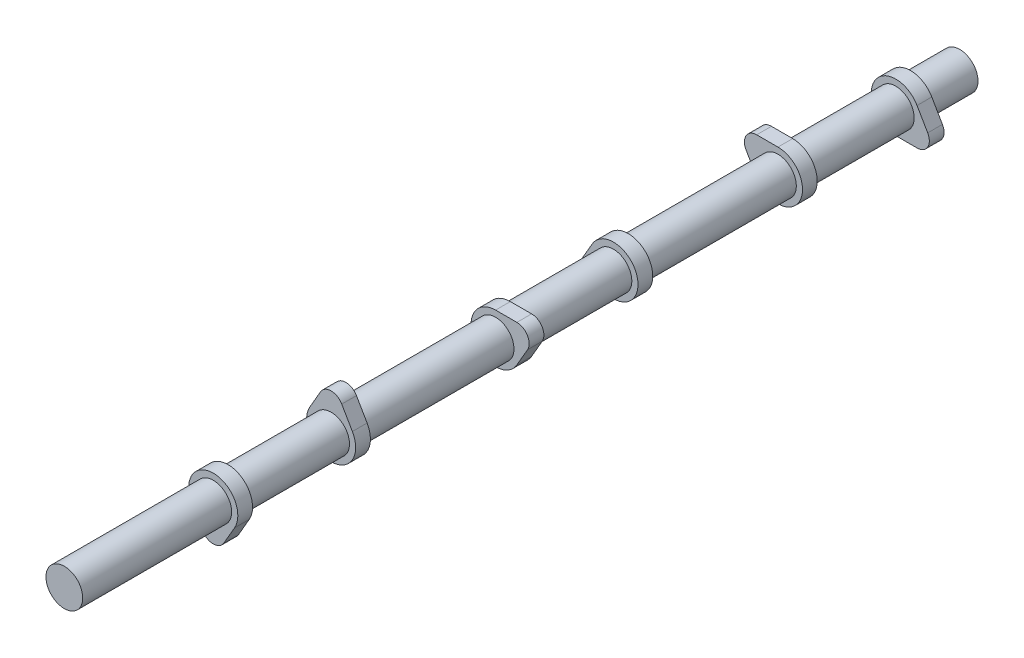
ISO-10303-21;
HEADER;
FILE_DESCRIPTION(('STEP AP214'),'2;1');
FILE_NAME('part.step','',(''),(''),'','','');
FILE_SCHEMA(('AUTOMOTIVE_DESIGN { 1 0 10303 214 1 1 1 1 }'));
ENDSEC;
DATA;
#1=APPLICATION_CONTEXT('core data for automotive mechanical design processes');
#2=APPLICATION_PROTOCOL_DEFINITION('international standard','automotive_design',2000,#1);
#3=PRODUCT_CONTEXT('',#1,'mechanical');
#4=PRODUCT('Part','Part','',(#3));
#5=PRODUCT_RELATED_PRODUCT_CATEGORY('part','',(#4));
#6=PRODUCT_DEFINITION_FORMATION('','',#4);
#7=PRODUCT_DEFINITION_CONTEXT('part definition',#1,'design');
#8=PRODUCT_DEFINITION('design','',#6,#7);
#9=PRODUCT_DEFINITION_SHAPE('','',#8);
#10=(LENGTH_UNIT() NAMED_UNIT(*) SI_UNIT(.MILLI.,.METRE.));
#11=(NAMED_UNIT(*) PLANE_ANGLE_UNIT() SI_UNIT($,.RADIAN.));
#12=(NAMED_UNIT(*) SI_UNIT($,.STERADIAN.) SOLID_ANGLE_UNIT());
#13=UNCERTAINTY_MEASURE_WITH_UNIT(LENGTH_MEASURE(1.E-05),#10,'distance_accuracy_value','');
#14=(GEOMETRIC_REPRESENTATION_CONTEXT(3) GLOBAL_UNCERTAINTY_ASSIGNED_CONTEXT((#13)) GLOBAL_UNIT_ASSIGNED_CONTEXT((#10,
#11,#12)) REPRESENTATION_CONTEXT('',''));
#15=CARTESIAN_POINT('',(0.,0.,0.));
#16=DIRECTION('',(0.,0.,1.));
#17=DIRECTION('',(1.,0.,0.));
#18=AXIS2_PLACEMENT_3D('',#15,#16,#17);
#19=CARTESIAN_POINT('',(-10.9985226280624,6.34999999999997,-223.52));
#20=DIRECTION('',(0.,0.,-1.));
#21=DIRECTION('',(-0.499999999999998,-0.86602540378444,0.));
#22=AXIS2_PLACEMENT_3D('',#19,#20,#21);
#23=CYLINDRICAL_SURFACE('',#22,6.35);
#24=CARTESIAN_POINT('',(-10.9985226280624,6.34999999999997,-231.14));
#25=DIRECTION('',(0.,0.,1.));
#26=DIRECTION('',(0.499999999999998,0.86602540378444,0.));
#27=AXIS2_PLACEMENT_3D('',#24,#25,#26);
#28=CIRCLE('',#27,6.35);
#29=CARTESIAN_POINT('',(-10.9985226280624,12.7,-231.14));
#30=VERTEX_POINT('',#29);
#31=CARTESIAN_POINT('',(-16.4977839420936,3.17499999999996,-231.14));
#32=VERTEX_POINT('',#31);
#33=EDGE_CURVE('E393',#30,#32,#28,.T.);
#34=ORIENTED_EDGE('',*,*,#33,.T.);
#35=DIRECTION('',(0.,0.,-1.));
#36=VECTOR('',#35,1.);
#37=CARTESIAN_POINT('',(-16.4977839420936,3.17499999999996,-223.52));
#38=LINE('',#37,#36);
#39=CARTESIAN_POINT('',(-16.4977839420936,3.17499999999996,-223.52));
#40=VERTEX_POINT('',#39);
#41=EDGE_CURVE('E412',#40,#32,#38,.T.);
#42=ORIENTED_EDGE('',*,*,#41,.F.);
#43=CARTESIAN_POINT('',(-10.9985226280624,6.34999999999997,-223.52));
#44=DIRECTION('',(0.,0.,1.));
#45=DIRECTION('',(0.499999999999998,0.86602540378444,0.));
#46=AXIS2_PLACEMENT_3D('',#43,#44,#45);
#47=CIRCLE('',#46,6.35);
#48=CARTESIAN_POINT('',(-10.9985226280624,12.7,-223.52));
#49=VERTEX_POINT('',#48);
#50=EDGE_CURVE('E394',#49,#40,#47,.T.);
#51=ORIENTED_EDGE('',*,*,#50,.F.);
#52=DIRECTION('',(0.,0.,-1.));
#53=VECTOR('',#52,1.);
#54=CARTESIAN_POINT('',(-10.9985226280624,12.7,-223.52));
#55=LINE('',#54,#53);
#56=EDGE_CURVE('E400',#49,#30,#55,.T.);
#57=ORIENTED_EDGE('',*,*,#56,.T.);
#58=EDGE_LOOP('',(#34,#42,#51,#57));
#59=FACE_BOUND('',#58,.T.);
#60=ADVANCED_FACE('F41',(#59),#23,.T.);
#61=CARTESIAN_POINT('',(-16.4977839420936,3.17499999999996,-223.52));
#62=DIRECTION('',(0.866025403784437,0.500000000000002,0.));
#63=DIRECTION('',(-0.500000000000002,0.866025403784437,0.));
#64=AXIS2_PLACEMENT_3D('',#61,#62,#63);
#65=PLANE('',#64);
#66=DIRECTION('',(0.500000000000002,-0.866025403784437,0.));
#67=VECTOR('',#66,1.);
#68=CARTESIAN_POINT('',(-16.4977839420936,3.17499999999996,-231.14));
#69=LINE('',#68,#67);
#70=CARTESIAN_POINT('',(-10.9985226280624,-6.35000000000002,-231.14));
#71=VERTEX_POINT('',#70);
#72=EDGE_CURVE('E403',#32,#71,#69,.T.);
#73=ORIENTED_EDGE('',*,*,#72,.T.);
#74=DIRECTION('',(0.,0.,-1.));
#75=VECTOR('',#74,1.);
#76=CARTESIAN_POINT('',(-10.9985226280624,-6.35000000000002,-223.52));
#77=LINE('',#76,#75);
#78=CARTESIAN_POINT('',(-10.9985226280624,-6.35000000000002,-223.52));
#79=VERTEX_POINT('',#78);
#80=EDGE_CURVE('E410',#79,#71,#77,.T.);
#81=ORIENTED_EDGE('',*,*,#80,.F.);
#82=DIRECTION('',(0.500000000000002,-0.866025403784437,0.));
#83=VECTOR('',#82,1.);
#84=CARTESIAN_POINT('',(-16.4977839420936,3.17499999999996,-223.52));
#85=LINE('',#84,#83);
#86=EDGE_CURVE('E90',#40,#79,#85,.T.);
#87=ORIENTED_EDGE('',*,*,#86,.F.);
#88=ORIENTED_EDGE('',*,*,#41,.T.);
#89=EDGE_LOOP('',(#73,#81,#87,#88));
#90=FACE_BOUND('',#89,.T.);
#91=ADVANCED_FACE('F431',(#90),#65,.F.);
#92=CARTESIAN_POINT('',(0.,0.,-223.52));
#93=DIRECTION('',(0.,0.,-1.));
#94=DIRECTION('',(-0.499999999999998,-0.86602540378444,0.));
#95=AXIS2_PLACEMENT_3D('',#92,#93,#94);
#96=CYLINDRICAL_SURFACE('',#95,12.7);
#97=CARTESIAN_POINT('',(0.,0.,-231.14));
#98=DIRECTION('',(0.,0.,1.));
#99=DIRECTION('',(0.499999999999998,0.86602540378444,0.));
#100=AXIS2_PLACEMENT_3D('',#97,#98,#99);
#101=CIRCLE('',#100,12.7);
#102=CARTESIAN_POINT('',(0.,12.7,-231.14));
#103=VERTEX_POINT('',#102);
#104=EDGE_CURVE('E76',#71,#103,#101,.T.);
#105=ORIENTED_EDGE('',*,*,#104,.T.);
#106=DIRECTION('',(0.,0.,-1.));
#107=VECTOR('',#106,1.);
#108=CARTESIAN_POINT('',(0.,12.7,-223.52));
#109=LINE('',#108,#107);
#110=CARTESIAN_POINT('',(0.,12.7,-223.52));
#111=VERTEX_POINT('',#110);
#112=EDGE_CURVE('E408',#111,#103,#109,.T.);
#113=ORIENTED_EDGE('',*,*,#112,.F.);
#114=CARTESIAN_POINT('',(0.,0.,-223.52));
#115=DIRECTION('',(0.,0.,1.));
#116=DIRECTION('',(0.499999999999998,0.86602540378444,0.));
#117=AXIS2_PLACEMENT_3D('',#114,#115,#116);
#118=CIRCLE('',#117,12.7);
#119=EDGE_CURVE('E397',#79,#111,#118,.T.);
#120=ORIENTED_EDGE('',*,*,#119,.F.);
#121=ORIENTED_EDGE('',*,*,#80,.T.);
#122=EDGE_LOOP('',(#105,#113,#120,#121));
#123=FACE_BOUND('',#122,.T.);
#124=ADVANCED_FACE('F430',(#123),#96,.T.);
#125=CARTESIAN_POINT('',(-10.9985226280624,12.7,-223.52));
#126=DIRECTION('',(0.,-1.,0.));
#127=DIRECTION('',(1.,0.,0.));
#128=AXIS2_PLACEMENT_3D('',#125,#126,#127);
#129=PLANE('',#128);
#130=DIRECTION('',(-1.,0.,0.));
#131=VECTOR('',#130,1.);
#132=CARTESIAN_POINT('',(-10.9985226280624,12.7,-231.14));
#133=LINE('',#132,#131);
#134=EDGE_CURVE('E82',#103,#30,#133,.T.);
#135=ORIENTED_EDGE('',*,*,#134,.T.);
#136=ORIENTED_EDGE('',*,*,#56,.F.);
#137=DIRECTION('',(-1.,0.,0.));
#138=VECTOR('',#137,1.);
#139=CARTESIAN_POINT('',(-10.9985226280624,12.7,-223.52));
#140=LINE('',#139,#138);
#141=EDGE_CURVE('E58',#111,#49,#140,.T.);
#142=ORIENTED_EDGE('',*,*,#141,.F.);
#143=ORIENTED_EDGE('',*,*,#112,.T.);
#144=EDGE_LOOP('',(#135,#136,#142,#143));
#145=FACE_BOUND('',#144,.T.);
#146=ADVANCED_FACE('F428',(#145),#129,.F.);
#147=CARTESIAN_POINT('',(-10.9985226280624,6.34999999999997,-223.52));
#148=DIRECTION('',(0.,0.,1.));
#149=DIRECTION('',(0.499999999999998,0.86602540378444,0.));
#150=AXIS2_PLACEMENT_3D('',#147,#148,#149);
#151=PLANE('',#150);
#152=CARTESIAN_POINT('',(0.,0.,-223.52));
#153=DIRECTION('',(0.,0.,1.));
#154=DIRECTION('',(-0.499999999999992,-0.866025403784443,0.));
#155=AXIS2_PLACEMENT_3D('',#152,#153,#154);
#156=CIRCLE('',#155,9.5);
#157=CARTESIAN_POINT('',(-4.74999999999992,-8.22724133595221,-223.52));
#158=VERTEX_POINT('',#157);
#159=EDGE_CURVE('E390',#158,#158,#156,.F.);
#160=ORIENTED_EDGE('',*,*,#159,.T.);
#161=EDGE_LOOP('',(#160));
#162=FACE_BOUND('',#161,.T.);
#163=ORIENTED_EDGE('',*,*,#50,.T.);
#164=ORIENTED_EDGE('',*,*,#86,.T.);
#165=ORIENTED_EDGE('',*,*,#119,.T.);
#166=ORIENTED_EDGE('',*,*,#141,.T.);
#167=EDGE_LOOP('',(#163,#164,#165,#166));
#168=FACE_BOUND('',#167,.T.);
#169=ADVANCED_FACE('F422',(#162,#168),#151,.T.);
#170=CARTESIAN_POINT('',(-10.9985226280624,6.34999999999997,-231.14));
#171=DIRECTION('',(0.,0.,1.));
#172=DIRECTION('',(0.499999999999998,0.86602540378444,0.));
#173=AXIS2_PLACEMENT_3D('',#170,#171,#172);
#174=PLANE('',#173);
#175=CARTESIAN_POINT('',(0.,0.,-231.14));
#176=DIRECTION('',(0.,0.,1.));
#177=DIRECTION('',(-0.499999999999992,-0.866025403784443,0.));
#178=AXIS2_PLACEMENT_3D('',#175,#176,#177);
#179=CIRCLE('',#178,9.5);
#180=CARTESIAN_POINT('',(-4.74999999999992,-8.22724133595221,-231.14));
#181=VERTEX_POINT('',#180);
#182=EDGE_CURVE('E50',#181,#181,#179,.F.);
#183=ORIENTED_EDGE('',*,*,#182,.F.);
#184=EDGE_LOOP('',(#183));
#185=FACE_BOUND('',#184,.T.);
#186=ORIENTED_EDGE('',*,*,#33,.F.);
#187=ORIENTED_EDGE('',*,*,#134,.F.);
#188=ORIENTED_EDGE('',*,*,#104,.F.);
#189=ORIENTED_EDGE('',*,*,#72,.F.);
#190=EDGE_LOOP('',(#186,#187,#188,#189));
#191=FACE_BOUND('',#190,.T.);
#192=ADVANCED_FACE('F419',(#185,#191),#174,.F.);
#193=CARTESIAN_POINT('',(0.,0.,-171.45));
#194=DIRECTION('',(0.,0.,-1.));
#195=DIRECTION('',(0.499999999999992,0.866025403784443,0.));
#196=AXIS2_PLACEMENT_3D('',#193,#194,#195);
#197=CYLINDRICAL_SURFACE('',#196,9.5);
#198=CARTESIAN_POINT('',(0.,0.,-284.48));
#199=DIRECTION('',(0.,0.,1.));
#200=DIRECTION('',(-0.499999999999992,-0.866025403784443,0.));
#201=AXIS2_PLACEMENT_3D('',#198,#199,#200);
#202=CIRCLE('',#201,9.5);
#203=CARTESIAN_POINT('',(-4.74999999999992,-8.22724133595221,-284.48));
#204=VERTEX_POINT('',#203);
#205=EDGE_CURVE('E44',#204,#204,#202,.T.);
#206=ORIENTED_EDGE('',*,*,#205,.T.);
#207=EDGE_LOOP('',(#206));
#208=FACE_BOUND('',#207,.T.);
#209=ORIENTED_EDGE('',*,*,#182,.T.);
#210=EDGE_LOOP('',(#209));
#211=FACE_BOUND('',#210,.T.);
#212=ADVANCED_FACE('F417',(#208,#211),#197,.T.);
#213=ORIENTED_EDGE('',*,*,#159,.F.);
#214=EDGE_LOOP('',(#213));
#215=FACE_BOUND('',#214,.T.);
#216=CARTESIAN_POINT('',(0.,0.,-146.05));
#217=DIRECTION('',(0.,0.,1.));
#218=DIRECTION('',(-0.500000000000004,0.866025403784436,0.));
#219=AXIS2_PLACEMENT_3D('',#216,#217,#218);
#220=CIRCLE('',#219,9.5);
#221=CARTESIAN_POINT('',(-4.75000000000004,8.22724133595215,-146.05));
#222=VERTEX_POINT('',#221);
#223=EDGE_CURVE('E352',#222,#222,#220,.T.);
#224=ORIENTED_EDGE('',*,*,#223,.F.);
#225=EDGE_LOOP('',(#224));
#226=FACE_BOUND('',#225,.T.);
#227=ADVANCED_FACE('F445',(#215,#226),#197,.T.);
#228=CARTESIAN_POINT('',(10.9985226280624,-6.3499999999999,-284.48));
#229=DIRECTION('',(0.,0.,-1.));
#230=DIRECTION('',(0.499999999999992,0.866025403784443,0.));
#231=AXIS2_PLACEMENT_3D('',#228,#229,#230);
#232=CYLINDRICAL_SURFACE('',#231,6.35);
#233=CARTESIAN_POINT('',(10.9985226280624,-6.3499999999999,-292.1));
#234=DIRECTION('',(0.,0.,1.));
#235=DIRECTION('',(-0.499999999999992,-0.866025403784443,0.));
#236=AXIS2_PLACEMENT_3D('',#233,#234,#235);
#237=CIRCLE('',#236,6.35);
#238=CARTESIAN_POINT('',(10.9985226280625,-12.6999999999999,-292.1));
#239=VERTEX_POINT('',#238);
#240=CARTESIAN_POINT('',(16.4977839420936,-3.17499999999985,-292.1));
#241=VERTEX_POINT('',#240);
#242=EDGE_CURVE('E355',#239,#241,#237,.T.);
#243=ORIENTED_EDGE('',*,*,#242,.T.);
#244=DIRECTION('',(0.,0.,-1.));
#245=VECTOR('',#244,1.);
#246=CARTESIAN_POINT('',(16.4977839420936,-3.17499999999985,-284.48));
#247=LINE('',#246,#245);
#248=CARTESIAN_POINT('',(16.4977839420936,-3.17499999999985,-284.48));
#249=VERTEX_POINT('',#248);
#250=EDGE_CURVE('E384',#249,#241,#247,.T.);
#251=ORIENTED_EDGE('',*,*,#250,.F.);
#252=CARTESIAN_POINT('',(10.9985226280624,-6.3499999999999,-284.48));
#253=DIRECTION('',(0.,0.,1.));
#254=DIRECTION('',(-0.499999999999992,-0.866025403784443,0.));
#255=AXIS2_PLACEMENT_3D('',#252,#253,#254);
#256=CIRCLE('',#255,6.35);
#257=CARTESIAN_POINT('',(10.9985226280625,-12.6999999999999,-284.48));
#258=VERTEX_POINT('',#257);
#259=EDGE_CURVE('E358',#258,#249,#256,.T.);
#260=ORIENTED_EDGE('',*,*,#259,.F.);
#261=DIRECTION('',(0.,0.,-1.));
#262=VECTOR('',#261,1.);
#263=CARTESIAN_POINT('',(10.9985226280625,-12.6999999999999,-284.48));
#264=LINE('',#263,#262);
#265=EDGE_CURVE('E368',#258,#239,#264,.T.);
#266=ORIENTED_EDGE('',*,*,#265,.T.);
#267=EDGE_LOOP('',(#243,#251,#260,#266));
#268=FACE_BOUND('',#267,.T.);
#269=ADVANCED_FACE('F448',(#268),#232,.T.);
#270=CARTESIAN_POINT('',(16.4977839420936,-3.17499999999985,-284.48));
#271=DIRECTION('',(-0.866025403784434,-0.500000000000008,0.));
#272=DIRECTION('',(0.500000000000008,-0.866025403784434,0.));
#273=AXIS2_PLACEMENT_3D('',#270,#271,#272);
#274=PLANE('',#273);
#275=DIRECTION('',(-0.500000000000008,0.866025403784434,0.));
#276=VECTOR('',#275,1.);
#277=CARTESIAN_POINT('',(16.4977839420936,-3.17499999999985,-292.1));
#278=LINE('',#277,#276);
#279=CARTESIAN_POINT('',(10.9985226280623,6.3500000000001,-292.1));
#280=VERTEX_POINT('',#279);
#281=EDGE_CURVE('E371',#241,#280,#278,.T.);
#282=ORIENTED_EDGE('',*,*,#281,.T.);
#283=DIRECTION('',(0.,0.,-1.));
#284=VECTOR('',#283,1.);
#285=CARTESIAN_POINT('',(10.9985226280623,6.3500000000001,-284.48));
#286=LINE('',#285,#284);
#287=CARTESIAN_POINT('',(10.9985226280623,6.3500000000001,-284.48));
#288=VERTEX_POINT('',#287);
#289=EDGE_CURVE('E381',#288,#280,#286,.T.);
#290=ORIENTED_EDGE('',*,*,#289,.F.);
#291=DIRECTION('',(-0.500000000000008,0.866025403784434,0.));
#292=VECTOR('',#291,1.);
#293=CARTESIAN_POINT('',(16.4977839420936,-3.17499999999985,-284.48));
#294=LINE('',#293,#292);
#295=EDGE_CURVE('E361',#249,#288,#294,.T.);
#296=ORIENTED_EDGE('',*,*,#295,.F.);
#297=ORIENTED_EDGE('',*,*,#250,.T.);
#298=EDGE_LOOP('',(#282,#290,#296,#297));
#299=FACE_BOUND('',#298,.T.);
#300=ADVANCED_FACE('F458',(#299),#274,.F.);
#301=CARTESIAN_POINT('',(0.,0.,-284.48));
#302=DIRECTION('',(0.,0.,-1.));
#303=DIRECTION('',(0.499999999999992,0.866025403784443,0.));
#304=AXIS2_PLACEMENT_3D('',#301,#302,#303);
#305=CYLINDRICAL_SURFACE('',#304,12.7);
#306=CARTESIAN_POINT('',(0.,0.,-292.1));
#307=DIRECTION('',(0.,0.,1.));
#308=DIRECTION('',(-0.499999999999992,-0.866025403784443,0.));
#309=AXIS2_PLACEMENT_3D('',#306,#307,#308);
#310=CIRCLE('',#309,12.7);
#311=CARTESIAN_POINT('',(1.21430643318376E-13,-12.7,-292.1));
#312=VERTEX_POINT('',#311);
#313=EDGE_CURVE('E373',#280,#312,#310,.T.);
#314=ORIENTED_EDGE('',*,*,#313,.T.);
#315=DIRECTION('',(0.,0.,-1.));
#316=VECTOR('',#315,1.);
#317=CARTESIAN_POINT('',(1.21430643318376E-13,-12.7,-284.48));
#318=LINE('',#317,#316);
#319=CARTESIAN_POINT('',(1.21430643318376E-13,-12.7,-284.48));
#320=VERTEX_POINT('',#319);
#321=EDGE_CURVE('E378',#320,#312,#318,.T.);
#322=ORIENTED_EDGE('',*,*,#321,.F.);
#323=CARTESIAN_POINT('',(0.,0.,-284.48));
#324=DIRECTION('',(0.,0.,1.));
#325=DIRECTION('',(-0.499999999999992,-0.866025403784443,0.));
#326=AXIS2_PLACEMENT_3D('',#323,#324,#325);
#327=CIRCLE('',#326,12.7);
#328=EDGE_CURVE('E364',#288,#320,#327,.T.);
#329=ORIENTED_EDGE('',*,*,#328,.F.);
#330=ORIENTED_EDGE('',*,*,#289,.T.);
#331=EDGE_LOOP('',(#314,#322,#329,#330));
#332=FACE_BOUND('',#331,.T.);
#333=ADVANCED_FACE('F462',(#332),#305,.T.);
#334=CARTESIAN_POINT('',(10.9985226280625,-12.6999999999999,-284.48));
#335=DIRECTION('',(0.,1.,0.));
#336=DIRECTION('',(-1.,0.,0.));
#337=AXIS2_PLACEMENT_3D('',#334,#335,#336);
#338=PLANE('',#337);
#339=DIRECTION('',(1.,0.,0.));
#340=VECTOR('',#339,1.);
#341=CARTESIAN_POINT('',(10.9985226280625,-12.6999999999999,-292.1));
#342=LINE('',#341,#340);
#343=EDGE_CURVE('E362',#312,#239,#342,.T.);
#344=ORIENTED_EDGE('',*,*,#343,.T.);
#345=ORIENTED_EDGE('',*,*,#265,.F.);
#346=DIRECTION('',(1.,0.,0.));
#347=VECTOR('',#346,1.);
#348=CARTESIAN_POINT('',(10.9985226280625,-12.6999999999999,-284.48));
#349=LINE('',#348,#347);
#350=EDGE_CURVE('E366',#320,#258,#349,.T.);
#351=ORIENTED_EDGE('',*,*,#350,.F.);
#352=ORIENTED_EDGE('',*,*,#321,.T.);
#353=EDGE_LOOP('',(#344,#345,#351,#352));
#354=FACE_BOUND('',#353,.T.);
#355=ADVANCED_FACE('F466',(#354),#338,.F.);
#356=CARTESIAN_POINT('',(10.9985226280624,-6.3499999999999,-284.48));
#357=DIRECTION('',(0.,0.,1.));
#358=DIRECTION('',(-0.499999999999992,-0.866025403784443,0.));
#359=AXIS2_PLACEMENT_3D('',#356,#357,#358);
#360=PLANE('',#359);
#361=ORIENTED_EDGE('',*,*,#205,.F.);
#362=EDGE_LOOP('',(#361));
#363=FACE_BOUND('',#362,.T.);
#364=ORIENTED_EDGE('',*,*,#259,.T.);
#365=ORIENTED_EDGE('',*,*,#295,.T.);
#366=ORIENTED_EDGE('',*,*,#328,.T.);
#367=ORIENTED_EDGE('',*,*,#350,.T.);
#368=EDGE_LOOP('',(#364,#365,#366,#367));
#369=FACE_BOUND('',#368,.T.);
#370=ADVANCED_FACE('F470',(#363,#369),#360,.T.);
#371=CARTESIAN_POINT('',(10.9985226280624,-6.3499999999999,-292.1));
#372=DIRECTION('',(0.,0.,1.));
#373=DIRECTION('',(-0.499999999999992,-0.866025403784443,0.));
#374=AXIS2_PLACEMENT_3D('',#371,#372,#373);
#375=PLANE('',#374);
#376=CARTESIAN_POINT('',(0.,0.,-292.1));
#377=DIRECTION('',(0.,0.,1.));
#378=DIRECTION('',(-0.499999999999992,-0.866025403784443,0.));
#379=AXIS2_PLACEMENT_3D('',#376,#377,#378);
#380=CIRCLE('',#379,9.5);
#381=CARTESIAN_POINT('',(-4.74999999999992,-8.22724133595221,-292.1));
#382=VERTEX_POINT('',#381);
#383=EDGE_CURVE('E11',#382,#382,#380,.T.);
#384=ORIENTED_EDGE('',*,*,#383,.T.);
#385=EDGE_LOOP('',(#384));
#386=FACE_BOUND('',#385,.T.);
#387=ORIENTED_EDGE('',*,*,#242,.F.);
#388=ORIENTED_EDGE('',*,*,#343,.F.);
#389=ORIENTED_EDGE('',*,*,#313,.F.);
#390=ORIENTED_EDGE('',*,*,#281,.F.);
#391=EDGE_LOOP('',(#387,#388,#389,#390));
#392=FACE_BOUND('',#391,.T.);
#393=ADVANCED_FACE('F454',(#386,#392),#375,.F.);
#394=CARTESIAN_POINT('',(0.,0.,-317.5));
#395=DIRECTION('',(0.,0.,1.));
#396=DIRECTION('',(-0.499999999999992,-0.866025403784443,0.));
#397=AXIS2_PLACEMENT_3D('',#394,#395,#396);
#398=PLANE('',#397);
#399=CARTESIAN_POINT('',(0.,0.,-317.5));
#400=DIRECTION('',(0.,0.,1.));
#401=DIRECTION('',(-0.499999999999992,-0.866025403784443,0.));
#402=AXIS2_PLACEMENT_3D('',#399,#400,#401);
#403=CIRCLE('',#402,9.5);
#404=CARTESIAN_POINT('',(-4.74999999999992,-8.22724133595221,-317.5));
#405=VERTEX_POINT('',#404);
#406=EDGE_CURVE('E387',#405,#405,#403,.T.);
#407=ORIENTED_EDGE('',*,*,#406,.F.);
#408=EDGE_LOOP('',(#407));
#409=FACE_BOUND('',#408,.T.);
#410=ADVANCED_FACE('F451',(#409),#398,.F.);
#411=ORIENTED_EDGE('',*,*,#406,.T.);
#412=EDGE_LOOP('',(#411));
#413=FACE_BOUND('',#412,.T.);
#414=ORIENTED_EDGE('',*,*,#383,.F.);
#415=EDGE_LOOP('',(#414));
#416=FACE_BOUND('',#415,.T.);
#417=ADVANCED_FACE('F450',(#413,#416),#197,.T.);
#418=CARTESIAN_POINT('',(10.9985226280624,6.34999999999997,-77.47));
#419=DIRECTION('',(0.,0.,-1.));
#420=DIRECTION('',(-0.499999999999998,0.86602540378444,0.));
#421=AXIS2_PLACEMENT_3D('',#418,#419,#420);
#422=CYLINDRICAL_SURFACE('',#421,6.35);
#423=CARTESIAN_POINT('',(10.9985226280624,6.34999999999997,-85.09));
#424=DIRECTION('',(0.,0.,1.));
#425=DIRECTION('',(0.499999999999998,-0.86602540378444,0.));
#426=AXIS2_PLACEMENT_3D('',#423,#424,#425);
#427=CIRCLE('',#426,6.35);
#428=CARTESIAN_POINT('',(16.4977839420936,3.17499999999996,-85.09));
#429=VERTEX_POINT('',#428);
#430=CARTESIAN_POINT('',(10.9985226280624,12.7,-85.09));
#431=VERTEX_POINT('',#430);
#432=EDGE_CURVE('E319',#429,#431,#427,.T.);
#433=ORIENTED_EDGE('',*,*,#432,.T.);
#434=DIRECTION('',(0.,0.,-1.));
#435=VECTOR('',#434,1.);
#436=CARTESIAN_POINT('',(10.9985226280624,12.7,-77.47));
#437=LINE('',#436,#435);
#438=CARTESIAN_POINT('',(10.9985226280624,12.7,-77.47));
#439=VERTEX_POINT('',#438);
#440=EDGE_CURVE('E346',#439,#431,#437,.T.);
#441=ORIENTED_EDGE('',*,*,#440,.F.);
#442=CARTESIAN_POINT('',(10.9985226280624,6.34999999999997,-77.47));
#443=DIRECTION('',(0.,0.,1.));
#444=DIRECTION('',(0.499999999999998,-0.86602540378444,0.));
#445=AXIS2_PLACEMENT_3D('',#442,#443,#444);
#446=CIRCLE('',#445,6.35);
#447=CARTESIAN_POINT('',(16.4977839420936,3.17499999999996,-77.47));
#448=VERTEX_POINT('',#447);
#449=EDGE_CURVE('E320',#448,#439,#446,.T.);
#450=ORIENTED_EDGE('',*,*,#449,.F.);
#451=DIRECTION('',(0.,0.,-1.));
#452=VECTOR('',#451,1.);
#453=CARTESIAN_POINT('',(16.4977839420936,3.17499999999996,-77.47));
#454=LINE('',#453,#452);
#455=EDGE_CURVE('E330',#448,#429,#454,.T.);
#456=ORIENTED_EDGE('',*,*,#455,.T.);
#457=EDGE_LOOP('',(#433,#441,#450,#456));
#458=FACE_BOUND('',#457,.T.);
#459=ADVANCED_FACE('F478',(#458),#422,.T.);
#460=CARTESIAN_POINT('',(10.9985226280624,12.7,-77.47));
#461=DIRECTION('',(0.,-1.,0.));
#462=DIRECTION('',(1.,0.,0.));
#463=AXIS2_PLACEMENT_3D('',#460,#461,#462);
#464=PLANE('',#463);
#465=DIRECTION('',(-1.,0.,0.));
#466=VECTOR('',#465,1.);
#467=CARTESIAN_POINT('',(10.9985226280624,12.7,-85.09));
#468=LINE('',#467,#466);
#469=CARTESIAN_POINT('',(0.,12.7,-85.09));
#470=VERTEX_POINT('',#469);
#471=EDGE_CURVE('E333',#431,#470,#468,.T.);
#472=ORIENTED_EDGE('',*,*,#471,.T.);
#473=DIRECTION('',(0.,0.,-1.));
#474=VECTOR('',#473,1.);
#475=CARTESIAN_POINT('',(0.,12.7,-77.47));
#476=LINE('',#475,#474);
#477=CARTESIAN_POINT('',(0.,12.7,-77.47));
#478=VERTEX_POINT('',#477);
#479=EDGE_CURVE('E343',#478,#470,#476,.T.);
#480=ORIENTED_EDGE('',*,*,#479,.F.);
#481=DIRECTION('',(-1.,0.,0.));
#482=VECTOR('',#481,1.);
#483=CARTESIAN_POINT('',(10.9985226280624,12.7,-77.47));
#484=LINE('',#483,#482);
#485=EDGE_CURVE('E323',#439,#478,#484,.T.);
#486=ORIENTED_EDGE('',*,*,#485,.F.);
#487=ORIENTED_EDGE('',*,*,#440,.T.);
#488=EDGE_LOOP('',(#472,#480,#486,#487));
#489=FACE_BOUND('',#488,.T.);
#490=ADVANCED_FACE('F481',(#489),#464,.F.);
#491=CARTESIAN_POINT('',(0.,0.,-77.47));
#492=DIRECTION('',(0.,0.,-1.));
#493=DIRECTION('',(-0.499999999999998,0.86602540378444,0.));
#494=AXIS2_PLACEMENT_3D('',#491,#492,#493);
#495=CYLINDRICAL_SURFACE('',#494,12.7);
#496=CARTESIAN_POINT('',(0.,0.,-85.09));
#497=DIRECTION('',(0.,0.,1.));
#498=DIRECTION('',(0.499999999999998,-0.86602540378444,0.));
#499=AXIS2_PLACEMENT_3D('',#496,#497,#498);
#500=CIRCLE('',#499,12.7);
#501=CARTESIAN_POINT('',(10.9985226280624,-6.35000000000002,-85.09));
#502=VERTEX_POINT('',#501);
#503=EDGE_CURVE('E335',#470,#502,#500,.T.);
#504=ORIENTED_EDGE('',*,*,#503,.T.);
#505=DIRECTION('',(0.,0.,-1.));
#506=VECTOR('',#505,1.);
#507=CARTESIAN_POINT('',(10.9985226280624,-6.35000000000002,-77.47));
#508=LINE('',#507,#506);
#509=CARTESIAN_POINT('',(10.9985226280624,-6.35000000000002,-77.47));
#510=VERTEX_POINT('',#509);
#511=EDGE_CURVE('E340',#510,#502,#508,.T.);
#512=ORIENTED_EDGE('',*,*,#511,.F.);
#513=CARTESIAN_POINT('',(0.,0.,-77.47));
#514=DIRECTION('',(0.,0.,1.));
#515=DIRECTION('',(0.499999999999998,-0.86602540378444,0.));
#516=AXIS2_PLACEMENT_3D('',#513,#514,#515);
#517=CIRCLE('',#516,12.7);
#518=EDGE_CURVE('E326',#478,#510,#517,.T.);
#519=ORIENTED_EDGE('',*,*,#518,.F.);
#520=ORIENTED_EDGE('',*,*,#479,.T.);
#521=EDGE_LOOP('',(#504,#512,#519,#520));
#522=FACE_BOUND('',#521,.T.);
#523=ADVANCED_FACE('F485',(#522),#495,.T.);
#524=CARTESIAN_POINT('',(16.4977839420936,3.17499999999996,-77.47));
#525=DIRECTION('',(-0.866025403784438,0.500000000000002,0.));
#526=DIRECTION('',(-0.500000000000002,-0.866025403784438,0.));
#527=AXIS2_PLACEMENT_3D('',#524,#525,#526);
#528=PLANE('',#527);
#529=DIRECTION('',(0.500000000000002,0.866025403784438,0.));
#530=VECTOR('',#529,1.);
#531=CARTESIAN_POINT('',(16.4977839420936,3.17499999999996,-85.09));
#532=LINE('',#531,#530);
#533=EDGE_CURVE('E324',#502,#429,#532,.T.);
#534=ORIENTED_EDGE('',*,*,#533,.T.);
#535=ORIENTED_EDGE('',*,*,#455,.F.);
#536=DIRECTION('',(0.500000000000002,0.866025403784438,0.));
#537=VECTOR('',#536,1.);
#538=CARTESIAN_POINT('',(16.4977839420936,3.17499999999996,-77.47));
#539=LINE('',#538,#537);
#540=EDGE_CURVE('E328',#510,#448,#539,.T.);
#541=ORIENTED_EDGE('',*,*,#540,.F.);
#542=ORIENTED_EDGE('',*,*,#511,.T.);
#543=EDGE_LOOP('',(#534,#535,#541,#542));
#544=FACE_BOUND('',#543,.T.);
#545=ADVANCED_FACE('F489',(#544),#528,.F.);
#546=CARTESIAN_POINT('',(10.9985226280624,6.34999999999997,-77.47));
#547=DIRECTION('',(0.,0.,1.));
#548=DIRECTION('',(0.499999999999998,-0.86602540378444,0.));
#549=AXIS2_PLACEMENT_3D('',#546,#547,#548);
#550=PLANE('',#549);
#551=CARTESIAN_POINT('',(0.,0.,-77.47));
#552=DIRECTION('',(0.,0.,1.));
#553=DIRECTION('',(-0.500000000000004,0.866025403784436,0.));
#554=AXIS2_PLACEMENT_3D('',#551,#552,#553);
#555=CIRCLE('',#554,9.5);
#556=CARTESIAN_POINT('',(-4.75000000000004,8.22724133595215,-77.47));
#557=VERTEX_POINT('',#556);
#558=EDGE_CURVE('E316',#557,#557,#555,.F.);
#559=ORIENTED_EDGE('',*,*,#558,.T.);
#560=EDGE_LOOP('',(#559));
#561=FACE_BOUND('',#560,.T.);
#562=ORIENTED_EDGE('',*,*,#449,.T.);
#563=ORIENTED_EDGE('',*,*,#485,.T.);
#564=ORIENTED_EDGE('',*,*,#518,.T.);
#565=ORIENTED_EDGE('',*,*,#540,.T.);
#566=EDGE_LOOP('',(#562,#563,#564,#565));
#567=FACE_BOUND('',#566,.T.);
#568=ADVANCED_FACE('F493',(#561,#567),#550,.T.);
#569=CARTESIAN_POINT('',(10.9985226280624,6.34999999999997,-85.09));
#570=DIRECTION('',(0.,0.,1.));
#571=DIRECTION('',(0.499999999999998,-0.86602540378444,0.));
#572=AXIS2_PLACEMENT_3D('',#569,#570,#571);
#573=PLANE('',#572);
#574=CARTESIAN_POINT('',(0.,0.,-85.09));
#575=DIRECTION('',(0.,0.,1.));
#576=DIRECTION('',(-0.500000000000004,0.866025403784436,0.));
#577=AXIS2_PLACEMENT_3D('',#574,#575,#576);
#578=CIRCLE('',#577,9.5);
#579=CARTESIAN_POINT('',(-4.75000000000004,8.22724133595215,-85.09));
#580=VERTEX_POINT('',#579);
#581=EDGE_CURVE('E349',#580,#580,#578,.F.);
#582=ORIENTED_EDGE('',*,*,#581,.F.);
#583=EDGE_LOOP('',(#582));
#584=FACE_BOUND('',#583,.T.);
#585=ORIENTED_EDGE('',*,*,#432,.F.);
#586=ORIENTED_EDGE('',*,*,#533,.F.);
#587=ORIENTED_EDGE('',*,*,#503,.F.);
#588=ORIENTED_EDGE('',*,*,#471,.F.);
#589=EDGE_LOOP('',(#585,#586,#587,#588));
#590=FACE_BOUND('',#589,.T.);
#591=ADVANCED_FACE('F495',(#584,#590),#573,.F.);
#592=CARTESIAN_POINT('',(0.,0.,-25.4));
#593=DIRECTION('',(0.,0.,-1.));
#594=DIRECTION('',(0.500000000000004,-0.866025403784436,0.));
#595=AXIS2_PLACEMENT_3D('',#592,#593,#594);
#596=CYLINDRICAL_SURFACE('',#595,9.5);
#597=CARTESIAN_POINT('',(0.,0.,-138.43));
#598=DIRECTION('',(0.,0.,1.));
#599=DIRECTION('',(-0.500000000000004,0.866025403784436,0.));
#600=AXIS2_PLACEMENT_3D('',#597,#598,#599);
#601=CIRCLE('',#600,9.5);
#602=CARTESIAN_POINT('',(-4.75000000000004,8.22724133595215,-138.43));
#603=VERTEX_POINT('',#602);
#604=EDGE_CURVE('E315',#603,#603,#601,.T.);
#605=ORIENTED_EDGE('',*,*,#604,.T.);
#606=EDGE_LOOP('',(#605));
#607=FACE_BOUND('',#606,.T.);
#608=ORIENTED_EDGE('',*,*,#581,.T.);
#609=EDGE_LOOP('',(#608));
#610=FACE_BOUND('',#609,.T.);
#611=ADVANCED_FACE('F498',(#607,#610),#596,.T.);
#612=ORIENTED_EDGE('',*,*,#558,.F.);
#613=EDGE_LOOP('',(#612));
#614=FACE_BOUND('',#613,.T.);
#615=CARTESIAN_POINT('',(0.,0.,0.));
#616=DIRECTION('',(0.,0.,1.));
#617=DIRECTION('',(1.,0.,0.));
#618=AXIS2_PLACEMENT_3D('',#615,#616,#617);
#619=CIRCLE('',#618,9.5);
#620=CARTESIAN_POINT('',(9.5,0.,0.));
#621=VERTEX_POINT('',#620);
#622=EDGE_CURVE('E282',#621,#621,#619,.T.);
#623=ORIENTED_EDGE('',*,*,#622,.F.);
#624=EDGE_LOOP('',(#623));
#625=FACE_BOUND('',#624,.T.);
#626=ADVANCED_FACE('F503',(#614,#625),#596,.T.);
#627=CARTESIAN_POINT('',(-10.9985226280623,-6.35000000000005,-138.43));
#628=DIRECTION('',(0.,0.,-1.));
#629=DIRECTION('',(0.500000000000004,-0.866025403784436,0.));
#630=AXIS2_PLACEMENT_3D('',#627,#628,#629);
#631=CYLINDRICAL_SURFACE('',#630,6.35);
#632=CARTESIAN_POINT('',(-10.9985226280623,-6.35000000000005,-146.05));
#633=DIRECTION('',(0.,0.,1.));
#634=DIRECTION('',(-0.500000000000004,0.866025403784436,0.));
#635=AXIS2_PLACEMENT_3D('',#632,#633,#634);
#636=CIRCLE('',#635,6.35);
#637=CARTESIAN_POINT('',(-16.4977839420935,-3.17500000000008,-146.05));
#638=VERTEX_POINT('',#637);
#639=CARTESIAN_POINT('',(-10.9985226280623,-12.7000000000001,-146.05));
#640=VERTEX_POINT('',#639);
#641=EDGE_CURVE('E284',#638,#640,#636,.T.);
#642=ORIENTED_EDGE('',*,*,#641,.T.);
#643=DIRECTION('',(0.,0.,-1.));
#644=VECTOR('',#643,1.);
#645=CARTESIAN_POINT('',(-10.9985226280623,-12.7000000000001,-138.43));
#646=LINE('',#645,#644);
#647=CARTESIAN_POINT('',(-10.9985226280623,-12.7000000000001,-138.43));
#648=VERTEX_POINT('',#647);
#649=EDGE_CURVE('E312',#648,#640,#646,.T.);
#650=ORIENTED_EDGE('',*,*,#649,.F.);
#651=CARTESIAN_POINT('',(-10.9985226280623,-6.35000000000005,-138.43));
#652=DIRECTION('',(0.,0.,1.));
#653=DIRECTION('',(-0.500000000000004,0.866025403784436,0.));
#654=AXIS2_PLACEMENT_3D('',#651,#652,#653);
#655=CIRCLE('',#654,6.35);
#656=CARTESIAN_POINT('',(-16.4977839420935,-3.17500000000008,-138.43));
#657=VERTEX_POINT('',#656);
#658=EDGE_CURVE('E286',#657,#648,#655,.T.);
#659=ORIENTED_EDGE('',*,*,#658,.F.);
#660=DIRECTION('',(0.,0.,-1.));
#661=VECTOR('',#660,1.);
#662=CARTESIAN_POINT('',(-16.4977839420935,-3.17500000000008,-138.43));
#663=LINE('',#662,#661);
#664=EDGE_CURVE('E296',#657,#638,#663,.T.);
#665=ORIENTED_EDGE('',*,*,#664,.T.);
#666=EDGE_LOOP('',(#642,#650,#659,#665));
#667=FACE_BOUND('',#666,.T.);
#668=ADVANCED_FACE('F506',(#667),#631,.T.);
#669=CARTESIAN_POINT('',(-10.9985226280623,-12.7000000000001,-138.43));
#670=DIRECTION('',(0.,1.,0.));
#671=DIRECTION('',(-1.,0.,0.));
#672=AXIS2_PLACEMENT_3D('',#669,#670,#671);
#673=PLANE('',#672);
#674=DIRECTION('',(1.,0.,0.));
#675=VECTOR('',#674,1.);
#676=CARTESIAN_POINT('',(-10.9985226280623,-12.7000000000001,-146.05));
#677=LINE('',#676,#675);
#678=CARTESIAN_POINT('',(0.,-12.7,-146.05));
#679=VERTEX_POINT('',#678);
#680=EDGE_CURVE('E299',#640,#679,#677,.T.);
#681=ORIENTED_EDGE('',*,*,#680,.T.);
#682=DIRECTION('',(0.,0.,-1.));
#683=VECTOR('',#682,1.);
#684=CARTESIAN_POINT('',(0.,-12.7,-138.43));
#685=LINE('',#684,#683);
#686=CARTESIAN_POINT('',(0.,-12.7,-138.43));
#687=VERTEX_POINT('',#686);
#688=EDGE_CURVE('E309',#687,#679,#685,.T.);
#689=ORIENTED_EDGE('',*,*,#688,.F.);
#690=DIRECTION('',(1.,0.,0.));
#691=VECTOR('',#690,1.);
#692=CARTESIAN_POINT('',(-10.9985226280623,-12.7000000000001,-138.43));
#693=LINE('',#692,#691);
#694=EDGE_CURVE('E289',#648,#687,#693,.T.);
#695=ORIENTED_EDGE('',*,*,#694,.F.);
#696=ORIENTED_EDGE('',*,*,#649,.T.);
#697=EDGE_LOOP('',(#681,#689,#695,#696));
#698=FACE_BOUND('',#697,.T.);
#699=ADVANCED_FACE('F510',(#698),#673,.F.);
#700=CARTESIAN_POINT('',(0.,0.,-138.43));
#701=DIRECTION('',(0.,0.,-1.));
#702=DIRECTION('',(0.500000000000004,-0.866025403784436,0.));
#703=AXIS2_PLACEMENT_3D('',#700,#701,#702);
#704=CYLINDRICAL_SURFACE('',#703,12.7);
#705=CARTESIAN_POINT('',(0.,0.,-146.05));
#706=DIRECTION('',(0.,0.,1.));
#707=DIRECTION('',(-0.500000000000004,0.866025403784436,0.));
#708=AXIS2_PLACEMENT_3D('',#705,#706,#707);
#709=CIRCLE('',#708,12.7);
#710=CARTESIAN_POINT('',(-10.9985226280624,6.34999999999995,-146.05));
#711=VERTEX_POINT('',#710);
#712=EDGE_CURVE('E301',#679,#711,#709,.T.);
#713=ORIENTED_EDGE('',*,*,#712,.T.);
#714=DIRECTION('',(0.,0.,-1.));
#715=VECTOR('',#714,1.);
#716=CARTESIAN_POINT('',(-10.9985226280624,6.34999999999995,-138.43));
#717=LINE('',#716,#715);
#718=CARTESIAN_POINT('',(-10.9985226280624,6.34999999999995,-138.43));
#719=VERTEX_POINT('',#718);
#720=EDGE_CURVE('E306',#719,#711,#717,.T.);
#721=ORIENTED_EDGE('',*,*,#720,.F.);
#722=CARTESIAN_POINT('',(0.,0.,-138.43));
#723=DIRECTION('',(0.,0.,1.));
#724=DIRECTION('',(-0.500000000000004,0.866025403784436,0.));
#725=AXIS2_PLACEMENT_3D('',#722,#723,#724);
#726=CIRCLE('',#725,12.7);
#727=EDGE_CURVE('E292',#687,#719,#726,.T.);
#728=ORIENTED_EDGE('',*,*,#727,.F.);
#729=ORIENTED_EDGE('',*,*,#688,.T.);
#730=EDGE_LOOP('',(#713,#721,#728,#729));
#731=FACE_BOUND('',#730,.T.);
#732=ADVANCED_FACE('F514',(#731),#704,.T.);
#733=CARTESIAN_POINT('',(-16.4977839420935,-3.17500000000008,-138.43));
#734=DIRECTION('',(0.866025403784441,-0.499999999999996,0.));
#735=DIRECTION('',(0.499999999999996,0.866025403784441,0.));
#736=AXIS2_PLACEMENT_3D('',#733,#734,#735);
#737=PLANE('',#736);
#738=DIRECTION('',(-0.499999999999996,-0.866025403784441,0.));
#739=VECTOR('',#738,1.);
#740=CARTESIAN_POINT('',(-16.4977839420935,-3.17500000000008,-146.05));
#741=LINE('',#740,#739);
#742=EDGE_CURVE('E290',#711,#638,#741,.T.);
#743=ORIENTED_EDGE('',*,*,#742,.T.);
#744=ORIENTED_EDGE('',*,*,#664,.F.);
#745=DIRECTION('',(-0.499999999999996,-0.866025403784441,0.));
#746=VECTOR('',#745,1.);
#747=CARTESIAN_POINT('',(-16.4977839420935,-3.17500000000008,-138.43));
#748=LINE('',#747,#746);
#749=EDGE_CURVE('E294',#719,#657,#748,.T.);
#750=ORIENTED_EDGE('',*,*,#749,.F.);
#751=ORIENTED_EDGE('',*,*,#720,.T.);
#752=EDGE_LOOP('',(#743,#744,#750,#751));
#753=FACE_BOUND('',#752,.T.);
#754=ADVANCED_FACE('F518',(#753),#737,.F.);
#755=CARTESIAN_POINT('',(-10.9985226280623,-6.35000000000005,-138.43));
#756=DIRECTION('',(0.,0.,1.));
#757=DIRECTION('',(-0.500000000000004,0.866025403784436,0.));
#758=AXIS2_PLACEMENT_3D('',#755,#756,#757);
#759=PLANE('',#758);
#760=ORIENTED_EDGE('',*,*,#604,.F.);
#761=EDGE_LOOP('',(#760));
#762=FACE_BOUND('',#761,.T.);
#763=ORIENTED_EDGE('',*,*,#658,.T.);
#764=ORIENTED_EDGE('',*,*,#694,.T.);
#765=ORIENTED_EDGE('',*,*,#727,.T.);
#766=ORIENTED_EDGE('',*,*,#749,.T.);
#767=EDGE_LOOP('',(#763,#764,#765,#766));
#768=FACE_BOUND('',#767,.T.);
#769=ADVANCED_FACE('F522',(#762,#768),#759,.T.);
#770=CARTESIAN_POINT('',(-10.9985226280623,-6.35000000000005,-146.05));
#771=DIRECTION('',(0.,0.,1.));
#772=DIRECTION('',(-0.500000000000004,0.866025403784436,0.));
#773=AXIS2_PLACEMENT_3D('',#770,#771,#772);
#774=PLANE('',#773);
#775=ORIENTED_EDGE('',*,*,#223,.T.);
#776=EDGE_LOOP('',(#775));
#777=FACE_BOUND('',#776,.T.);
#778=ORIENTED_EDGE('',*,*,#641,.F.);
#779=ORIENTED_EDGE('',*,*,#742,.F.);
#780=ORIENTED_EDGE('',*,*,#712,.F.);
#781=ORIENTED_EDGE('',*,*,#680,.F.);
#782=EDGE_LOOP('',(#778,#779,#780,#781));
#783=FACE_BOUND('',#782,.T.);
#784=ADVANCED_FACE('F524',(#777,#783),#774,.F.);
#785=CARTESIAN_POINT('',(0.,-12.7,68.58));
#786=DIRECTION('',(0.,0.,-1.));
#787=DIRECTION('',(1.,0.,0.));
#788=AXIS2_PLACEMENT_3D('',#785,#786,#787);
#789=CYLINDRICAL_SURFACE('',#788,6.35);
#790=CARTESIAN_POINT('',(0.,-12.7,60.96));
#791=DIRECTION('',(0.,0.,1.));
#792=DIRECTION('',(-1.,0.,0.));
#793=AXIS2_PLACEMENT_3D('',#790,#791,#792);
#794=CIRCLE('',#793,6.35);
#795=CARTESIAN_POINT('',(-5.49926131403129,-15.875,60.96));
#796=VERTEX_POINT('',#795);
#797=CARTESIAN_POINT('',(5.49926131403107,-15.875,60.96));
#798=VERTEX_POINT('',#797);
#799=EDGE_CURVE('E249',#796,#798,#794,.T.);
#800=ORIENTED_EDGE('',*,*,#799,.T.);
#801=DIRECTION('',(0.,0.,-1.));
#802=VECTOR('',#801,1.);
#803=CARTESIAN_POINT('',(5.49926131403107,-15.875,68.58));
#804=LINE('',#803,#802);
#805=CARTESIAN_POINT('',(5.49926131403107,-15.875,68.58));
#806=VERTEX_POINT('',#805);
#807=EDGE_CURVE('E276',#806,#798,#804,.T.);
#808=ORIENTED_EDGE('',*,*,#807,.F.);
#809=CARTESIAN_POINT('',(0.,-12.7,68.58));
#810=DIRECTION('',(0.,0.,1.));
#811=DIRECTION('',(-1.,0.,0.));
#812=AXIS2_PLACEMENT_3D('',#809,#810,#811);
#813=CIRCLE('',#812,6.35);
#814=CARTESIAN_POINT('',(-5.49926131403129,-15.875,68.58));
#815=VERTEX_POINT('',#814);
#816=EDGE_CURVE('E250',#815,#806,#813,.T.);
#817=ORIENTED_EDGE('',*,*,#816,.F.);
#818=DIRECTION('',(0.,0.,-1.));
#819=VECTOR('',#818,1.);
#820=CARTESIAN_POINT('',(-5.49926131403129,-15.875,68.58));
#821=LINE('',#820,#819);
#822=EDGE_CURVE('E260',#815,#796,#821,.T.);
#823=ORIENTED_EDGE('',*,*,#822,.T.);
#824=EDGE_LOOP('',(#800,#808,#817,#823));
#825=FACE_BOUND('',#824,.T.);
#826=ADVANCED_FACE('F527',(#825),#789,.T.);
#827=CARTESIAN_POINT('',(5.49926131403107,-15.875,68.58));
#828=DIRECTION('',(-0.866025403784435,0.500000000000006,0.));
#829=DIRECTION('',(-0.500000000000006,-0.866025403784435,0.));
#830=AXIS2_PLACEMENT_3D('',#827,#828,#829);
#831=PLANE('',#830);
#832=DIRECTION('',(0.500000000000006,0.866025403784435,0.));
#833=VECTOR('',#832,1.);
#834=CARTESIAN_POINT('',(5.49926131403107,-15.875,60.96));
#835=LINE('',#834,#833);
#836=CARTESIAN_POINT('',(10.9985226280623,-6.35000000000008,60.96));
#837=VERTEX_POINT('',#836);
#838=EDGE_CURVE('E263',#798,#837,#835,.T.);
#839=ORIENTED_EDGE('',*,*,#838,.T.);
#840=DIRECTION('',(0.,0.,-1.));
#841=VECTOR('',#840,1.);
#842=CARTESIAN_POINT('',(10.9985226280623,-6.35000000000008,68.58));
#843=LINE('',#842,#841);
#844=CARTESIAN_POINT('',(10.9985226280623,-6.35000000000008,68.58));
#845=VERTEX_POINT('',#844);
#846=EDGE_CURVE('E273',#845,#837,#843,.T.);
#847=ORIENTED_EDGE('',*,*,#846,.F.);
#848=DIRECTION('',(0.500000000000006,0.866025403784435,0.));
#849=VECTOR('',#848,1.);
#850=CARTESIAN_POINT('',(5.49926131403107,-15.875,68.58));
#851=LINE('',#850,#849);
#852=EDGE_CURVE('E253',#806,#845,#851,.T.);
#853=ORIENTED_EDGE('',*,*,#852,.F.);
#854=ORIENTED_EDGE('',*,*,#807,.T.);
#855=EDGE_LOOP('',(#839,#847,#853,#854));
#856=FACE_BOUND('',#855,.T.);
#857=ADVANCED_FACE('F534',(#856),#831,.F.);
#858=CARTESIAN_POINT('',(0.,0.,68.58));
#859=DIRECTION('',(0.,0.,-1.));
#860=DIRECTION('',(1.,0.,0.));
#861=AXIS2_PLACEMENT_3D('',#858,#859,#860);
#862=CYLINDRICAL_SURFACE('',#861,12.7);
#863=CARTESIAN_POINT('',(0.,0.,60.96));
#864=DIRECTION('',(0.,0.,1.));
#865=DIRECTION('',(-1.,0.,0.));
#866=AXIS2_PLACEMENT_3D('',#863,#864,#865);
#867=CIRCLE('',#866,12.7);
#868=CARTESIAN_POINT('',(-10.9985226280624,-6.34999999999993,60.96));
#869=VERTEX_POINT('',#868);
#870=EDGE_CURVE('E265',#837,#869,#867,.T.);
#871=ORIENTED_EDGE('',*,*,#870,.T.);
#872=DIRECTION('',(0.,0.,-1.));
#873=VECTOR('',#872,1.);
#874=CARTESIAN_POINT('',(-10.9985226280624,-6.34999999999993,68.58));
#875=LINE('',#874,#873);
#876=CARTESIAN_POINT('',(-10.9985226280624,-6.34999999999993,68.58));
#877=VERTEX_POINT('',#876);
#878=EDGE_CURVE('E270',#877,#869,#875,.T.);
#879=ORIENTED_EDGE('',*,*,#878,.F.);
#880=CARTESIAN_POINT('',(0.,0.,68.58));
#881=DIRECTION('',(0.,0.,1.));
#882=DIRECTION('',(-1.,0.,0.));
#883=AXIS2_PLACEMENT_3D('',#880,#881,#882);
#884=CIRCLE('',#883,12.7);
#885=EDGE_CURVE('E256',#845,#877,#884,.T.);
#886=ORIENTED_EDGE('',*,*,#885,.F.);
#887=ORIENTED_EDGE('',*,*,#846,.T.);
#888=EDGE_LOOP('',(#871,#879,#886,#887));
#889=FACE_BOUND('',#888,.T.);
#890=ADVANCED_FACE('F538',(#889),#862,.T.);
#891=CARTESIAN_POINT('',(-5.49926131403129,-15.875,68.58));
#892=DIRECTION('',(0.866025403784442,0.499999999999994,0.));
#893=DIRECTION('',(-0.499999999999994,0.866025403784442,0.));
#894=AXIS2_PLACEMENT_3D('',#891,#892,#893);
#895=PLANE('',#894);
#896=DIRECTION('',(0.499999999999994,-0.866025403784442,0.));
#897=VECTOR('',#896,1.);
#898=CARTESIAN_POINT('',(-5.49926131403129,-15.875,60.96));
#899=LINE('',#898,#897);
#900=EDGE_CURVE('E254',#869,#796,#899,.T.);
#901=ORIENTED_EDGE('',*,*,#900,.T.);
#902=ORIENTED_EDGE('',*,*,#822,.F.);
#903=DIRECTION('',(0.499999999999994,-0.866025403784442,0.));
#904=VECTOR('',#903,1.);
#905=CARTESIAN_POINT('',(-5.49926131403129,-15.875,68.58));
#906=LINE('',#905,#904);
#907=EDGE_CURVE('E258',#877,#815,#906,.T.);
#908=ORIENTED_EDGE('',*,*,#907,.F.);
#909=ORIENTED_EDGE('',*,*,#878,.T.);
#910=EDGE_LOOP('',(#901,#902,#908,#909));
#911=FACE_BOUND('',#910,.T.);
#912=ADVANCED_FACE('F542',(#911),#895,.F.);
#913=CARTESIAN_POINT('',(0.,-12.7,68.58));
#914=DIRECTION('',(0.,0.,1.));
#915=DIRECTION('',(-1.,0.,0.));
#916=AXIS2_PLACEMENT_3D('',#913,#914,#915);
#917=PLANE('',#916);
#918=CARTESIAN_POINT('',(0.,0.,68.58));
#919=DIRECTION('',(0.,0.,1.));
#920=DIRECTION('',(1.,0.,0.));
#921=AXIS2_PLACEMENT_3D('',#918,#919,#920);
#922=CIRCLE('',#921,9.5);
#923=CARTESIAN_POINT('',(9.5,0.,68.58));
#924=VERTEX_POINT('',#923);
#925=EDGE_CURVE('E241',#924,#924,#922,.F.);
#926=ORIENTED_EDGE('',*,*,#925,.T.);
#927=EDGE_LOOP('',(#926));
#928=FACE_BOUND('',#927,.T.);
#929=ORIENTED_EDGE('',*,*,#816,.T.);
#930=ORIENTED_EDGE('',*,*,#852,.T.);
#931=ORIENTED_EDGE('',*,*,#885,.T.);
#932=ORIENTED_EDGE('',*,*,#907,.T.);
#933=EDGE_LOOP('',(#929,#930,#931,#932));
#934=FACE_BOUND('',#933,.T.);
#935=ADVANCED_FACE('F546',(#928,#934),#917,.T.);
#936=CARTESIAN_POINT('',(0.,-12.7,60.96));
#937=DIRECTION('',(0.,0.,1.));
#938=DIRECTION('',(-1.,0.,0.));
#939=AXIS2_PLACEMENT_3D('',#936,#937,#938);
#940=PLANE('',#939);
#941=CARTESIAN_POINT('',(0.,0.,60.96));
#942=DIRECTION('',(0.,0.,1.));
#943=DIRECTION('',(1.,0.,0.));
#944=AXIS2_PLACEMENT_3D('',#941,#942,#943);
#945=CIRCLE('',#944,9.5);
#946=CARTESIAN_POINT('',(9.5,0.,60.96));
#947=VERTEX_POINT('',#946);
#948=EDGE_CURVE('E279',#947,#947,#945,.F.);
#949=ORIENTED_EDGE('',*,*,#948,.F.);
#950=EDGE_LOOP('',(#949));
#951=FACE_BOUND('',#950,.T.);
#952=ORIENTED_EDGE('',*,*,#799,.F.);
#953=ORIENTED_EDGE('',*,*,#900,.F.);
#954=ORIENTED_EDGE('',*,*,#870,.F.);
#955=ORIENTED_EDGE('',*,*,#838,.F.);
#956=EDGE_LOOP('',(#952,#953,#954,#955));
#957=FACE_BOUND('',#956,.T.);
#958=ADVANCED_FACE('F548',(#951,#957),#940,.F.);
#959=CARTESIAN_POINT('',(0.,0.,120.65));
#960=DIRECTION('',(0.,0.,-1.));
#961=DIRECTION('',(-1.,0.,0.));
#962=AXIS2_PLACEMENT_3D('',#959,#960,#961);
#963=CYLINDRICAL_SURFACE('',#962,9.5);
#964=CARTESIAN_POINT('',(0.,0.,7.62));
#965=DIRECTION('',(0.,0.,1.));
#966=DIRECTION('',(1.,0.,0.));
#967=AXIS2_PLACEMENT_3D('',#964,#965,#966);
#968=CIRCLE('',#967,9.5);
#969=CARTESIAN_POINT('',(9.5,0.,7.62));
#970=VERTEX_POINT('',#969);
#971=EDGE_CURVE('E238',#970,#970,#968,.T.);
#972=ORIENTED_EDGE('',*,*,#971,.T.);
#973=EDGE_LOOP('',(#972));
#974=FACE_BOUND('',#973,.T.);
#975=ORIENTED_EDGE('',*,*,#948,.T.);
#976=EDGE_LOOP('',(#975));
#977=FACE_BOUND('',#976,.T.);
#978=ADVANCED_FACE('F551',(#974,#977),#963,.T.);
#979=ORIENTED_EDGE('',*,*,#925,.F.);
#980=EDGE_LOOP('',(#979));
#981=FACE_BOUND('',#980,.T.);
#982=CARTESIAN_POINT('',(0.,0.,145.62));
#983=DIRECTION('',(0.,0.,1.));
#984=DIRECTION('',(1.,0.,0.));
#985=AXIS2_PLACEMENT_3D('',#982,#983,#984);
#986=CIRCLE('',#985,9.5);
#987=CARTESIAN_POINT('',(9.5,0.,145.62));
#988=VERTEX_POINT('',#987);
#989=EDGE_CURVE('E585',#988,#988,#986,.T.);
#990=ORIENTED_EDGE('',*,*,#989,.F.);
#991=EDGE_LOOP('',(#990));
#992=FACE_BOUND('',#991,.T.);
#993=ADVANCED_FACE('F556',(#981,#992),#963,.T.);
#994=CARTESIAN_POINT('',(0.,12.7,7.62));
#995=DIRECTION('',(0.,0.,-1.));
#996=DIRECTION('',(-1.,0.,0.));
#997=AXIS2_PLACEMENT_3D('',#994,#995,#996);
#998=CYLINDRICAL_SURFACE('',#997,6.35);
#999=CARTESIAN_POINT('',(0.,12.7,0.));
#1000=DIRECTION('',(0.,0.,1.));
#1001=DIRECTION('',(1.,0.,0.));
#1002=AXIS2_PLACEMENT_3D('',#999,#1000,#1001);
#1003=CIRCLE('',#1002,6.35);
#1004=CARTESIAN_POINT('',(5.49926131403118,15.875,0.));
#1005=VERTEX_POINT('',#1004);
#1006=CARTESIAN_POINT('',(-5.49926131403118,15.875,0.));
#1007=VERTEX_POINT('',#1006);
#1008=EDGE_CURVE('E237',#1005,#1007,#1003,.T.);
#1009=ORIENTED_EDGE('',*,*,#1008,.T.);
#1010=DIRECTION('',(0.,0.,-1.));
#1011=VECTOR('',#1010,1.);
#1012=CARTESIAN_POINT('',(-5.49926131403118,15.875,7.62));
#1013=LINE('',#1012,#1011);
#1014=CARTESIAN_POINT('',(-5.49926131403118,15.875,7.62));
#1015=VERTEX_POINT('',#1014);
#1016=EDGE_CURVE('E217',#1015,#1007,#1013,.T.);
#1017=ORIENTED_EDGE('',*,*,#1016,.F.);
#1018=CARTESIAN_POINT('',(0.,12.7,7.62));
#1019=DIRECTION('',(0.,0.,1.));
#1020=DIRECTION('',(1.,0.,0.));
#1021=AXIS2_PLACEMENT_3D('',#1018,#1019,#1020);
#1022=CIRCLE('',#1021,6.35);
#1023=CARTESIAN_POINT('',(5.49926131403118,15.875,7.62));
#1024=VERTEX_POINT('',#1023);
#1025=EDGE_CURVE('E224',#1024,#1015,#1022,.T.);
#1026=ORIENTED_EDGE('',*,*,#1025,.F.);
#1027=DIRECTION('',(0.,0.,-1.));
#1028=VECTOR('',#1027,1.);
#1029=CARTESIAN_POINT('',(5.49926131403118,15.875,7.62));
#1030=LINE('',#1029,#1028);
#1031=EDGE_CURVE('E592',#1024,#1005,#1030,.T.);
#1032=ORIENTED_EDGE('',*,*,#1031,.T.);
#1033=EDGE_LOOP('',(#1009,#1017,#1026,#1032));
#1034=FACE_BOUND('',#1033,.T.);
#1035=ADVANCED_FACE('F235',(#1034),#998,.T.);
#1036=CARTESIAN_POINT('',(-5.49926131403118,15.875,7.62));
#1037=DIRECTION('',(0.866025403784438,-0.5,0.));
#1038=DIRECTION('',(0.5,0.866025403784439,0.));
#1039=AXIS2_PLACEMENT_3D('',#1036,#1037,#1038);
#1040=PLANE('',#1039);
#1041=DIRECTION('',(-0.5,-0.866025403784439,0.));
#1042=VECTOR('',#1041,1.);
#1043=CARTESIAN_POINT('',(-5.49926131403118,15.875,0.));
#1044=LINE('',#1043,#1042);
#1045=CARTESIAN_POINT('',(-10.9985226280624,6.35,0.));
#1046=VERTEX_POINT('',#1045);
#1047=EDGE_CURVE('E588',#1007,#1046,#1044,.T.);
#1048=ORIENTED_EDGE('',*,*,#1047,.T.);
#1049=DIRECTION('',(0.,0.,-1.));
#1050=VECTOR('',#1049,1.);
#1051=CARTESIAN_POINT('',(-10.9985226280624,6.35,7.62));
#1052=LINE('',#1051,#1050);
#1053=CARTESIAN_POINT('',(-10.9985226280624,6.35,7.62));
#1054=VERTEX_POINT('',#1053);
#1055=EDGE_CURVE('E220',#1054,#1046,#1052,.T.);
#1056=ORIENTED_EDGE('',*,*,#1055,.F.);
#1057=DIRECTION('',(-0.5,-0.866025403784439,0.));
#1058=VECTOR('',#1057,1.);
#1059=CARTESIAN_POINT('',(-5.49926131403118,15.875,7.62));
#1060=LINE('',#1059,#1058);
#1061=EDGE_CURVE('E213',#1015,#1054,#1060,.T.);
#1062=ORIENTED_EDGE('',*,*,#1061,.F.);
#1063=ORIENTED_EDGE('',*,*,#1016,.T.);
#1064=EDGE_LOOP('',(#1048,#1056,#1062,#1063));
#1065=FACE_BOUND('',#1064,.T.);
#1066=ADVANCED_FACE('F215',(#1065),#1040,.F.);
#1067=CARTESIAN_POINT('',(0.,0.,7.62));
#1068=DIRECTION('',(0.,0.,-1.));
#1069=DIRECTION('',(-1.,0.,0.));
#1070=AXIS2_PLACEMENT_3D('',#1067,#1068,#1069);
#1071=CYLINDRICAL_SURFACE('',#1070,12.7);
#1072=CARTESIAN_POINT('',(0.,0.,0.));
#1073=DIRECTION('',(0.,0.,1.));
#1074=DIRECTION('',(1.,0.,0.));
#1075=AXIS2_PLACEMENT_3D('',#1072,#1073,#1074);
#1076=CIRCLE('',#1075,12.7);
#1077=CARTESIAN_POINT('',(10.9985226280624,6.35,0.));
#1078=VERTEX_POINT('',#1077);
#1079=EDGE_CURVE('E595',#1046,#1078,#1076,.T.);
#1080=ORIENTED_EDGE('',*,*,#1079,.T.);
#1081=DIRECTION('',(0.,0.,-1.));
#1082=VECTOR('',#1081,1.);
#1083=CARTESIAN_POINT('',(10.9985226280624,6.35,7.62));
#1084=LINE('',#1083,#1082);
#1085=CARTESIAN_POINT('',(10.9985226280624,6.35,7.62));
#1086=VERTEX_POINT('',#1085);
#1087=EDGE_CURVE('E243',#1086,#1078,#1084,.T.);
#1088=ORIENTED_EDGE('',*,*,#1087,.F.);
#1089=CARTESIAN_POINT('',(0.,0.,7.62));
#1090=DIRECTION('',(0.,0.,1.));
#1091=DIRECTION('',(1.,0.,0.));
#1092=AXIS2_PLACEMENT_3D('',#1089,#1090,#1091);
#1093=CIRCLE('',#1092,12.7);
#1094=EDGE_CURVE('E223',#1054,#1086,#1093,.T.);
#1095=ORIENTED_EDGE('',*,*,#1094,.F.);
#1096=ORIENTED_EDGE('',*,*,#1055,.T.);
#1097=EDGE_LOOP('',(#1080,#1088,#1095,#1096));
#1098=FACE_BOUND('',#1097,.T.);
#1099=ADVANCED_FACE('F564',(#1098),#1071,.T.);
#1100=CARTESIAN_POINT('',(5.49926131403118,15.875,7.62));
#1101=DIRECTION('',(-0.866025403784438,-0.5,0.));
#1102=DIRECTION('',(0.5,-0.866025403784439,0.));
#1103=AXIS2_PLACEMENT_3D('',#1100,#1101,#1102);
#1104=PLANE('',#1103);
#1105=DIRECTION('',(-0.5,0.866025403784439,0.));
#1106=VECTOR('',#1105,1.);
#1107=CARTESIAN_POINT('',(5.49926131403118,15.875,0.));
#1108=LINE('',#1107,#1106);
#1109=EDGE_CURVE('E233',#1078,#1005,#1108,.T.);
#1110=ORIENTED_EDGE('',*,*,#1109,.T.);
#1111=ORIENTED_EDGE('',*,*,#1031,.F.);
#1112=DIRECTION('',(-0.5,0.866025403784439,0.));
#1113=VECTOR('',#1112,1.);
#1114=CARTESIAN_POINT('',(5.49926131403118,15.875,7.62));
#1115=LINE('',#1114,#1113);
#1116=EDGE_CURVE('E229',#1086,#1024,#1115,.T.);
#1117=ORIENTED_EDGE('',*,*,#1116,.F.);
#1118=ORIENTED_EDGE('',*,*,#1087,.T.);
#1119=EDGE_LOOP('',(#1110,#1111,#1117,#1118));
#1120=FACE_BOUND('',#1119,.T.);
#1121=ADVANCED_FACE('F567',(#1120),#1104,.F.);
#1122=CARTESIAN_POINT('',(0.,12.7,7.62));
#1123=DIRECTION('',(0.,0.,1.));
#1124=DIRECTION('',(1.,0.,0.));
#1125=AXIS2_PLACEMENT_3D('',#1122,#1123,#1124);
#1126=PLANE('',#1125);
#1127=ORIENTED_EDGE('',*,*,#971,.F.);
#1128=EDGE_LOOP('',(#1127));
#1129=FACE_BOUND('',#1128,.T.);
#1130=ORIENTED_EDGE('',*,*,#1025,.T.);
#1131=ORIENTED_EDGE('',*,*,#1061,.T.);
#1132=ORIENTED_EDGE('',*,*,#1094,.T.);
#1133=ORIENTED_EDGE('',*,*,#1116,.T.);
#1134=EDGE_LOOP('',(#1130,#1131,#1132,#1133));
#1135=FACE_BOUND('',#1134,.T.);
#1136=ADVANCED_FACE('F227',(#1129,#1135),#1126,.T.);
#1137=CARTESIAN_POINT('',(0.,12.7,0.));
#1138=DIRECTION('',(0.,0.,1.));
#1139=DIRECTION('',(1.,0.,0.));
#1140=AXIS2_PLACEMENT_3D('',#1137,#1138,#1139);
#1141=PLANE('',#1140);
#1142=ORIENTED_EDGE('',*,*,#622,.T.);
#1143=EDGE_LOOP('',(#1142));
#1144=FACE_BOUND('',#1143,.T.);
#1145=ORIENTED_EDGE('',*,*,#1008,.F.);
#1146=ORIENTED_EDGE('',*,*,#1109,.F.);
#1147=ORIENTED_EDGE('',*,*,#1079,.F.);
#1148=ORIENTED_EDGE('',*,*,#1047,.F.);
#1149=EDGE_LOOP('',(#1145,#1146,#1147,#1148));
#1150=FACE_BOUND('',#1149,.T.);
#1151=ADVANCED_FACE('F572',(#1144,#1150),#1141,.F.);
#1152=CARTESIAN_POINT('',(0.,0.,145.62));
#1153=DIRECTION('',(0.,0.,1.));
#1154=DIRECTION('',(1.,0.,0.));
#1155=AXIS2_PLACEMENT_3D('',#1152,#1153,#1154);
#1156=PLANE('',#1155);
#1157=ORIENTED_EDGE('',*,*,#989,.T.);
#1158=EDGE_LOOP('',(#1157));
#1159=FACE_BOUND('',#1158,.T.);
#1160=ADVANCED_FACE('F575',(#1159),#1156,.T.);
#1161=CLOSED_SHELL('',(#60,#91,#124,#146,#169,#192,#212,#227,#269,#300,#333,#355,#370,#393,#410,
#417,#459,#490,#523,#545,#568,#591,#611,#626,#668,#699,#732,#754,#769,#784,#826,#857,#890,#912,
#935,#958,#978,#993,#1035,#1066,#1099,#1121,#1136,#1151,#1160));
#1162=MANIFOLD_SOLID_BREP('B2',#1161);
#1163=ADVANCED_BREP_SHAPE_REPRESENTATION('',(#18,#1162),#14);
#1164=SHAPE_DEFINITION_REPRESENTATION(#9,#1163);
ENDSEC;
END-ISO-10303-21;
